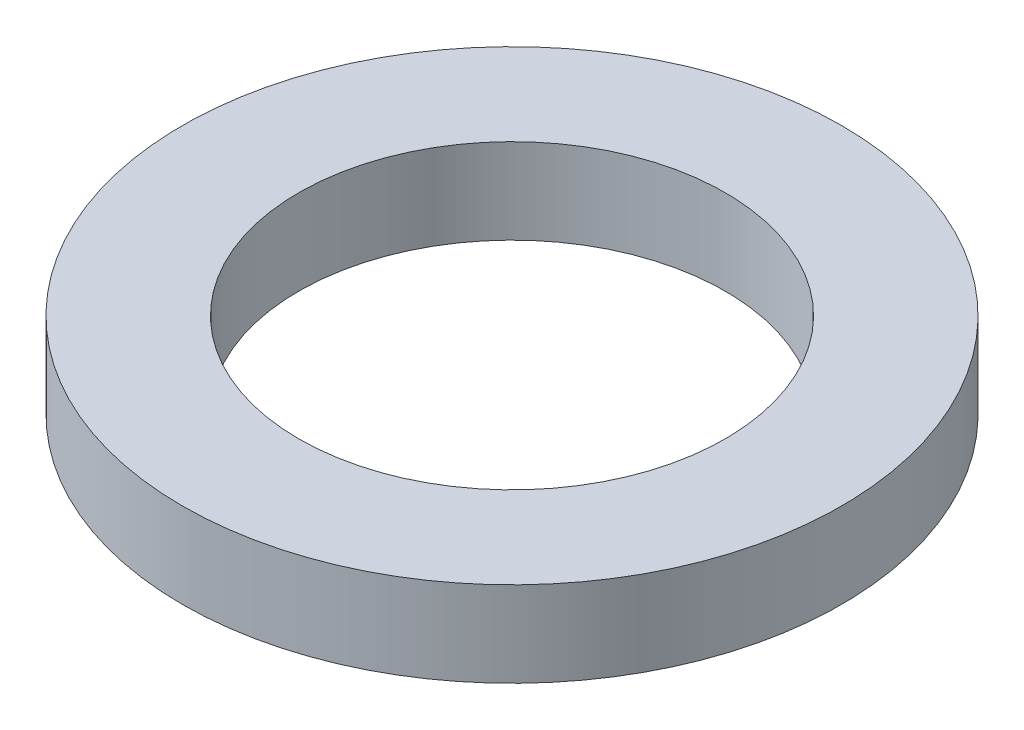
ISO-10303-21;
HEADER;
FILE_DESCRIPTION(('STEP AP214'),'2;1');
FILE_NAME('part.step','',(''),(''),'','','');
FILE_SCHEMA(('AUTOMOTIVE_DESIGN { 1 0 10303 214 1 1 1 1 }'));
ENDSEC;
DATA;
#1=APPLICATION_CONTEXT('core data for automotive mechanical design processes');
#2=APPLICATION_PROTOCOL_DEFINITION('international standard','automotive_design',2000,#1);
#3=PRODUCT_CONTEXT('',#1,'mechanical');
#4=PRODUCT('Part','Part','',(#3));
#5=PRODUCT_RELATED_PRODUCT_CATEGORY('part','',(#4));
#6=PRODUCT_DEFINITION_FORMATION('','',#4);
#7=PRODUCT_DEFINITION_CONTEXT('part definition',#1,'design');
#8=PRODUCT_DEFINITION('design','',#6,#7);
#9=PRODUCT_DEFINITION_SHAPE('','',#8);
#10=(LENGTH_UNIT() NAMED_UNIT(*) SI_UNIT(.MILLI.,.METRE.));
#11=(NAMED_UNIT(*) PLANE_ANGLE_UNIT() SI_UNIT($,.RADIAN.));
#12=(NAMED_UNIT(*) SI_UNIT($,.STERADIAN.) SOLID_ANGLE_UNIT());
#13=UNCERTAINTY_MEASURE_WITH_UNIT(LENGTH_MEASURE(1.E-05),#10,'distance_accuracy_value','');
#14=(GEOMETRIC_REPRESENTATION_CONTEXT(3) GLOBAL_UNCERTAINTY_ASSIGNED_CONTEXT((#13)) GLOBAL_UNIT_ASSIGNED_CONTEXT((#10,
#11,#12)) REPRESENTATION_CONTEXT('',''));
#15=CARTESIAN_POINT('',(0.,0.,0.));
#16=DIRECTION('',(0.,0.,1.));
#17=DIRECTION('',(1.,0.,0.));
#18=AXIS2_PLACEMENT_3D('',#15,#16,#17);
#19=CARTESIAN_POINT('',(0.,11.,0.));
#20=DIRECTION('',(0.,-1.,0.));
#21=DIRECTION('',(0.,0.,-1.));
#22=AXIS2_PLACEMENT_3D('',#19,#20,#21);
#23=CYLINDRICAL_SURFACE('',#22,42.5);
#24=CARTESIAN_POINT('',(0.,11.,0.));
#25=DIRECTION('',(0.,1.,0.));
#26=DIRECTION('',(0.,0.,1.));
#27=AXIS2_PLACEMENT_3D('',#24,#25,#26);
#28=CIRCLE('',#27,42.5);
#29=CARTESIAN_POINT('',(0.,11.,42.5));
#30=VERTEX_POINT('',#29);
#31=EDGE_CURVE('E10',#30,#30,#28,.T.);
#32=ORIENTED_EDGE('',*,*,#31,.F.);
#33=EDGE_LOOP('',(#32));
#34=FACE_BOUND('',#33,.T.);
#35=CARTESIAN_POINT('',(0.,0.,0.));
#36=DIRECTION('',(0.,1.,0.));
#37=DIRECTION('',(0.,0.,1.));
#38=AXIS2_PLACEMENT_3D('',#35,#36,#37);
#39=CIRCLE('',#38,42.5);
#40=CARTESIAN_POINT('',(0.,0.,42.5));
#41=VERTEX_POINT('',#40);
#42=EDGE_CURVE('E37',#41,#41,#39,.T.);
#43=ORIENTED_EDGE('',*,*,#42,.T.);
#44=EDGE_LOOP('',(#43));
#45=FACE_BOUND('',#44,.T.);
#46=ADVANCED_FACE('F40',(#34,#45),#23,.T.);
#47=CARTESIAN_POINT('',(0.,11.,0.));
#48=DIRECTION('',(0.,1.,0.));
#49=DIRECTION('',(0.,0.,1.));
#50=AXIS2_PLACEMENT_3D('',#47,#48,#49);
#51=PLANE('',#50);
#52=CARTESIAN_POINT('',(0.,11.,0.));
#53=DIRECTION('',(0.,1.,0.));
#54=DIRECTION('',(0.,0.,1.));
#55=AXIS2_PLACEMENT_3D('',#52,#53,#54);
#56=CIRCLE('',#55,27.5);
#57=CARTESIAN_POINT('',(0.,11.,27.5));
#58=VERTEX_POINT('',#57);
#59=EDGE_CURVE('E50',#58,#58,#56,.T.);
#60=ORIENTED_EDGE('',*,*,#59,.F.);
#61=EDGE_LOOP('',(#60));
#62=FACE_BOUND('',#61,.T.);
#63=ORIENTED_EDGE('',*,*,#31,.T.);
#64=EDGE_LOOP('',(#63));
#65=FACE_BOUND('',#64,.T.);
#66=ADVANCED_FACE('F59',(#62,#65),#51,.T.);
#67=CARTESIAN_POINT('',(0.,0.,0.));
#68=DIRECTION('',(0.,1.,0.));
#69=DIRECTION('',(0.,0.,1.));
#70=AXIS2_PLACEMENT_3D('',#67,#68,#69);
#71=PLANE('',#70);
#72=CARTESIAN_POINT('',(0.,0.,0.));
#73=DIRECTION('',(0.,1.,0.));
#74=DIRECTION('',(0.,0.,1.));
#75=AXIS2_PLACEMENT_3D('',#72,#73,#74);
#76=CIRCLE('',#75,27.5);
#77=CARTESIAN_POINT('',(0.,0.,27.5));
#78=VERTEX_POINT('',#77);
#79=EDGE_CURVE('E47',#78,#78,#76,.T.);
#80=ORIENTED_EDGE('',*,*,#79,.T.);
#81=EDGE_LOOP('',(#80));
#82=FACE_BOUND('',#81,.T.);
#83=ORIENTED_EDGE('',*,*,#42,.F.);
#84=EDGE_LOOP('',(#83));
#85=FACE_BOUND('',#84,.T.);
#86=ADVANCED_FACE('F58',(#82,#85),#71,.F.);
#87=CARTESIAN_POINT('',(0.,11.,0.));
#88=DIRECTION('',(0.,-1.,0.));
#89=DIRECTION('',(0.,0.,-1.));
#90=AXIS2_PLACEMENT_3D('',#87,#88,#89);
#91=CYLINDRICAL_SURFACE('',#90,27.5);
#92=ORIENTED_EDGE('',*,*,#59,.T.);
#93=EDGE_LOOP('',(#92));
#94=FACE_BOUND('',#93,.T.);
#95=ORIENTED_EDGE('',*,*,#79,.F.);
#96=EDGE_LOOP('',(#95));
#97=FACE_BOUND('',#96,.T.);
#98=ADVANCED_FACE('F54',(#94,#97),#91,.F.);
#99=CLOSED_SHELL('',(#46,#66,#86,#98));
#100=MANIFOLD_SOLID_BREP('B2',#99);
#101=ADVANCED_BREP_SHAPE_REPRESENTATION('',(#18,#100),#14);
#102=SHAPE_DEFINITION_REPRESENTATION(#9,#101);
ENDSEC;
END-ISO-10303-21;
